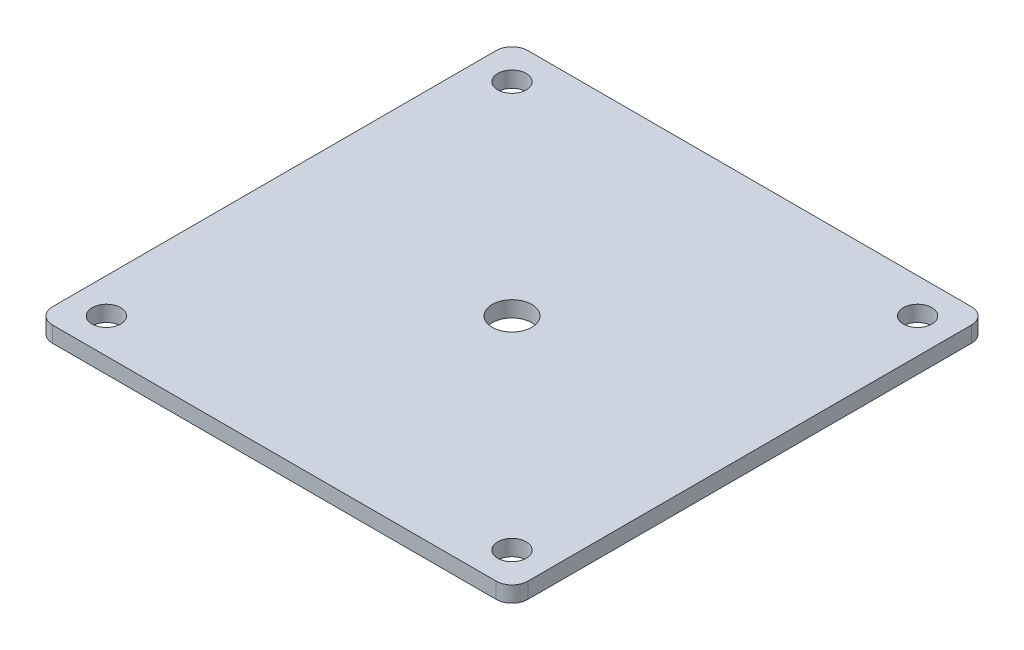
ISO-10303-21;
HEADER;
FILE_DESCRIPTION(('STEP AP214'),'2;1');
FILE_NAME('part.step','',(''),(''),'','','');
FILE_SCHEMA(('AUTOMOTIVE_DESIGN { 1 0 10303 214 1 1 1 1 }'));
ENDSEC;
DATA;
#1=APPLICATION_CONTEXT('core data for automotive mechanical design processes');
#2=APPLICATION_PROTOCOL_DEFINITION('international standard','automotive_design',2000,#1);
#3=PRODUCT_CONTEXT('',#1,'mechanical');
#4=PRODUCT('Part','Part','',(#3));
#5=PRODUCT_RELATED_PRODUCT_CATEGORY('part','',(#4));
#6=PRODUCT_DEFINITION_FORMATION('','',#4);
#7=PRODUCT_DEFINITION_CONTEXT('part definition',#1,'design');
#8=PRODUCT_DEFINITION('design','',#6,#7);
#9=PRODUCT_DEFINITION_SHAPE('','',#8);
#10=(LENGTH_UNIT() NAMED_UNIT(*) SI_UNIT(.MILLI.,.METRE.));
#11=(NAMED_UNIT(*) PLANE_ANGLE_UNIT() SI_UNIT($,.RADIAN.));
#12=(NAMED_UNIT(*) SI_UNIT($,.STERADIAN.) SOLID_ANGLE_UNIT());
#13=UNCERTAINTY_MEASURE_WITH_UNIT(LENGTH_MEASURE(1.E-05),#10,'distance_accuracy_value','');
#14=(GEOMETRIC_REPRESENTATION_CONTEXT(3) GLOBAL_UNCERTAINTY_ASSIGNED_CONTEXT((#13)) GLOBAL_UNIT_ASSIGNED_CONTEXT((#10,
#11,#12)) REPRESENTATION_CONTEXT('',''));
#15=CARTESIAN_POINT('',(0.,0.,0.));
#16=DIRECTION('',(0.,0.,1.));
#17=DIRECTION('',(1.,0.,0.));
#18=AXIS2_PLACEMENT_3D('',#15,#16,#17);
#19=CARTESIAN_POINT('',(38.1,2.54,-38.1));
#20=DIRECTION('',(-1.,0.,0.));
#21=DIRECTION('',(0.,0.,1.));
#22=AXIS2_PLACEMENT_3D('',#19,#20,#21);
#23=PLANE('',#22);
#24=DIRECTION('',(0.,0.,-1.));
#25=VECTOR('',#24,1.);
#26=CARTESIAN_POINT('',(38.1,2.54,-38.1));
#27=LINE('',#26,#25);
#28=CARTESIAN_POINT('',(38.1,2.54,35.56));
#29=VERTEX_POINT('',#28);
#30=CARTESIAN_POINT('',(38.1,2.54,-35.56));
#31=VERTEX_POINT('',#30);
#32=EDGE_CURVE('E128',#29,#31,#27,.T.);
#33=ORIENTED_EDGE('',*,*,#32,.F.);
#34=DIRECTION('',(0.,-1.,0.));
#35=VECTOR('',#34,1.);
#36=CARTESIAN_POINT('',(38.1,2.54,35.56));
#37=LINE('',#36,#35);
#38=CARTESIAN_POINT('',(38.1,0.,35.56));
#39=VERTEX_POINT('',#38);
#40=EDGE_CURVE('E11',#29,#39,#37,.T.);
#41=ORIENTED_EDGE('',*,*,#40,.T.);
#42=DIRECTION('',(0.,0.,-1.));
#43=VECTOR('',#42,1.);
#44=CARTESIAN_POINT('',(38.1,0.,-38.1));
#45=LINE('',#44,#43);
#46=CARTESIAN_POINT('',(38.1,0.,-35.56));
#47=VERTEX_POINT('',#46);
#48=EDGE_CURVE('E130',#39,#47,#45,.T.);
#49=ORIENTED_EDGE('',*,*,#48,.T.);
#50=DIRECTION('',(0.,-1.,0.));
#51=VECTOR('',#50,1.);
#52=CARTESIAN_POINT('',(38.1,2.54,-35.56));
#53=LINE('',#52,#51);
#54=EDGE_CURVE('E41',#47,#31,#53,.F.);
#55=ORIENTED_EDGE('',*,*,#54,.T.);
#56=EDGE_LOOP('',(#33,#41,#49,#55));
#57=FACE_BOUND('',#56,.T.);
#58=ADVANCED_FACE('F33',(#57),#23,.F.);
#59=CARTESIAN_POINT('',(-38.1,2.54,-38.1));
#60=DIRECTION('',(0.,0.,1.));
#61=DIRECTION('',(1.,0.,0.));
#62=AXIS2_PLACEMENT_3D('',#59,#60,#61);
#63=PLANE('',#62);
#64=DIRECTION('',(-1.,0.,0.));
#65=VECTOR('',#64,1.);
#66=CARTESIAN_POINT('',(-38.1,0.,-38.1));
#67=LINE('',#66,#65);
#68=CARTESIAN_POINT('',(35.56,0.,-38.1));
#69=VERTEX_POINT('',#68);
#70=CARTESIAN_POINT('',(-35.56,0.,-38.1));
#71=VERTEX_POINT('',#70);
#72=EDGE_CURVE('E126',#69,#71,#67,.T.);
#73=ORIENTED_EDGE('',*,*,#72,.T.);
#74=DIRECTION('',(0.,-1.,0.));
#75=VECTOR('',#74,1.);
#76=CARTESIAN_POINT('',(-35.56,2.54,-38.1));
#77=LINE('',#76,#75);
#78=CARTESIAN_POINT('',(-35.56,2.54,-38.1));
#79=VERTEX_POINT('',#78);
#80=EDGE_CURVE('E105',#71,#79,#77,.F.);
#81=ORIENTED_EDGE('',*,*,#80,.T.);
#82=DIRECTION('',(-1.,0.,0.));
#83=VECTOR('',#82,1.);
#84=CARTESIAN_POINT('',(-38.1,2.54,-38.1));
#85=LINE('',#84,#83);
#86=CARTESIAN_POINT('',(35.56,2.54,-38.1));
#87=VERTEX_POINT('',#86);
#88=EDGE_CURVE('E166',#87,#79,#85,.T.);
#89=ORIENTED_EDGE('',*,*,#88,.F.);
#90=DIRECTION('',(0.,-1.,0.));
#91=VECTOR('',#90,1.);
#92=CARTESIAN_POINT('',(35.56,2.54,-38.1));
#93=LINE('',#92,#91);
#94=EDGE_CURVE('E110',#87,#69,#93,.T.);
#95=ORIENTED_EDGE('',*,*,#94,.T.);
#96=EDGE_LOOP('',(#73,#81,#89,#95));
#97=FACE_BOUND('',#96,.T.);
#98=ADVANCED_FACE('F170',(#97),#63,.F.);
#99=CARTESIAN_POINT('',(-38.1,2.54,-38.1));
#100=DIRECTION('',(1.,0.,0.));
#101=DIRECTION('',(0.,0.,-1.));
#102=AXIS2_PLACEMENT_3D('',#99,#100,#101);
#103=PLANE('',#102);
#104=DIRECTION('',(0.,0.,1.));
#105=VECTOR('',#104,1.);
#106=CARTESIAN_POINT('',(-38.1,2.54,-38.1));
#107=LINE('',#106,#105);
#108=CARTESIAN_POINT('',(-38.1,2.54,-35.56));
#109=VERTEX_POINT('',#108);
#110=CARTESIAN_POINT('',(-38.1,2.54,35.56));
#111=VERTEX_POINT('',#110);
#112=EDGE_CURVE('E119',#109,#111,#107,.T.);
#113=ORIENTED_EDGE('',*,*,#112,.F.);
#114=DIRECTION('',(0.,-1.,0.));
#115=VECTOR('',#114,1.);
#116=CARTESIAN_POINT('',(-38.1,2.54,-35.56));
#117=LINE('',#116,#115);
#118=CARTESIAN_POINT('',(-38.1,0.,-35.56));
#119=VERTEX_POINT('',#118);
#120=EDGE_CURVE('E104',#109,#119,#117,.T.);
#121=ORIENTED_EDGE('',*,*,#120,.T.);
#122=DIRECTION('',(0.,0.,1.));
#123=VECTOR('',#122,1.);
#124=CARTESIAN_POINT('',(-38.1,0.,-38.1));
#125=LINE('',#124,#123);
#126=CARTESIAN_POINT('',(-38.1,0.,35.56));
#127=VERTEX_POINT('',#126);
#128=EDGE_CURVE('E117',#119,#127,#125,.T.);
#129=ORIENTED_EDGE('',*,*,#128,.T.);
#130=DIRECTION('',(0.,-1.,0.));
#131=VECTOR('',#130,1.);
#132=CARTESIAN_POINT('',(-38.1,2.54,35.56));
#133=LINE('',#132,#131);
#134=EDGE_CURVE('E121',#127,#111,#133,.F.);
#135=ORIENTED_EDGE('',*,*,#134,.T.);
#136=EDGE_LOOP('',(#113,#121,#129,#135));
#137=FACE_BOUND('',#136,.T.);
#138=ADVANCED_FACE('F116',(#137),#103,.F.);
#139=CARTESIAN_POINT('',(-38.1,2.54,38.1));
#140=DIRECTION('',(0.,0.,-1.));
#141=DIRECTION('',(-1.,0.,0.));
#142=AXIS2_PLACEMENT_3D('',#139,#140,#141);
#143=PLANE('',#142);
#144=DIRECTION('',(1.,0.,0.));
#145=VECTOR('',#144,1.);
#146=CARTESIAN_POINT('',(-38.1,2.54,38.1));
#147=LINE('',#146,#145);
#148=CARTESIAN_POINT('',(-35.56,2.54,38.1));
#149=VERTEX_POINT('',#148);
#150=CARTESIAN_POINT('',(35.56,2.54,38.1));
#151=VERTEX_POINT('',#150);
#152=EDGE_CURVE('E134',#149,#151,#147,.T.);
#153=ORIENTED_EDGE('',*,*,#152,.F.);
#154=DIRECTION('',(0.,-1.,0.));
#155=VECTOR('',#154,1.);
#156=CARTESIAN_POINT('',(-35.56,2.54,38.1));
#157=LINE('',#156,#155);
#158=CARTESIAN_POINT('',(-35.56,0.,38.1));
#159=VERTEX_POINT('',#158);
#160=EDGE_CURVE('E151',#149,#159,#157,.T.);
#161=ORIENTED_EDGE('',*,*,#160,.T.);
#162=DIRECTION('',(1.,0.,0.));
#163=VECTOR('',#162,1.);
#164=CARTESIAN_POINT('',(-38.1,0.,38.1));
#165=LINE('',#164,#163);
#166=CARTESIAN_POINT('',(35.56,0.,38.1));
#167=VERTEX_POINT('',#166);
#168=EDGE_CURVE('E125',#159,#167,#165,.T.);
#169=ORIENTED_EDGE('',*,*,#168,.T.);
#170=DIRECTION('',(0.,-1.,0.));
#171=VECTOR('',#170,1.);
#172=CARTESIAN_POINT('',(35.56,2.54,38.1));
#173=LINE('',#172,#171);
#174=EDGE_CURVE('E48',#167,#151,#173,.F.);
#175=ORIENTED_EDGE('',*,*,#174,.T.);
#176=EDGE_LOOP('',(#153,#161,#169,#175));
#177=FACE_BOUND('',#176,.T.);
#178=ADVANCED_FACE('F217',(#177),#143,.F.);
#179=CARTESIAN_POINT('',(0.,2.54,0.));
#180=DIRECTION('',(0.,1.,0.));
#181=DIRECTION('',(0.,0.,1.));
#182=AXIS2_PLACEMENT_3D('',#179,#180,#181);
#183=PLANE('',#182);
#184=CARTESIAN_POINT('',(0.,2.54,0.));
#185=DIRECTION('',(0.,1.,0.));
#186=DIRECTION('',(0.,0.,1.));
#187=AXIS2_PLACEMENT_3D('',#184,#185,#186);
#188=CIRCLE('',#187,3.175);
#189=CARTESIAN_POINT('',(0.,2.54,3.175));
#190=VERTEX_POINT('',#189);
#191=EDGE_CURVE('E200',#190,#190,#188,.T.);
#192=ORIENTED_EDGE('',*,*,#191,.F.);
#193=EDGE_LOOP('',(#192));
#194=FACE_BOUND('',#193,.T.);
#195=CARTESIAN_POINT('',(-32.512,2.54,32.512));
#196=DIRECTION('',(0.,1.,0.));
#197=DIRECTION('',(0.,0.,1.));
#198=AXIS2_PLACEMENT_3D('',#195,#196,#197);
#199=CIRCLE('',#198,2.286);
#200=CARTESIAN_POINT('',(-32.512,2.54,34.798));
#201=VERTEX_POINT('',#200);
#202=EDGE_CURVE('E182',#201,#201,#199,.T.);
#203=ORIENTED_EDGE('',*,*,#202,.F.);
#204=EDGE_LOOP('',(#203));
#205=FACE_BOUND('',#204,.T.);
#206=CARTESIAN_POINT('',(32.512,2.54,32.512));
#207=DIRECTION('',(0.,1.,0.));
#208=DIRECTION('',(0.,0.,1.));
#209=AXIS2_PLACEMENT_3D('',#206,#207,#208);
#210=CIRCLE('',#209,2.28599999999999);
#211=CARTESIAN_POINT('',(32.512,2.54,34.798));
#212=VERTEX_POINT('',#211);
#213=EDGE_CURVE('E189',#212,#212,#210,.T.);
#214=ORIENTED_EDGE('',*,*,#213,.F.);
#215=EDGE_LOOP('',(#214));
#216=FACE_BOUND('',#215,.T.);
#217=CARTESIAN_POINT('',(32.512,2.54,-32.512));
#218=DIRECTION('',(0.,1.,0.));
#219=DIRECTION('',(0.,0.,1.));
#220=AXIS2_PLACEMENT_3D('',#217,#218,#219);
#221=CIRCLE('',#220,2.28599999999999);
#222=CARTESIAN_POINT('',(32.512,2.54,-30.226));
#223=VERTEX_POINT('',#222);
#224=EDGE_CURVE('E195',#223,#223,#221,.T.);
#225=ORIENTED_EDGE('',*,*,#224,.F.);
#226=EDGE_LOOP('',(#225));
#227=FACE_BOUND('',#226,.T.);
#228=CARTESIAN_POINT('',(-32.512,2.54,-32.512));
#229=DIRECTION('',(0.,1.,0.));
#230=DIRECTION('',(0.,0.,1.));
#231=AXIS2_PLACEMENT_3D('',#228,#229,#230);
#232=CIRCLE('',#231,2.286);
#233=CARTESIAN_POINT('',(-32.512,2.54,-30.226));
#234=VERTEX_POINT('',#233);
#235=EDGE_CURVE('E173',#234,#234,#232,.T.);
#236=ORIENTED_EDGE('',*,*,#235,.F.);
#237=EDGE_LOOP('',(#236));
#238=FACE_BOUND('',#237,.T.);
#239=ORIENTED_EDGE('',*,*,#88,.T.);
#240=CARTESIAN_POINT('',(-35.56,2.54,-35.56));
#241=DIRECTION('',(0.,1.,0.));
#242=DIRECTION('',(0.,0.,1.));
#243=AXIS2_PLACEMENT_3D('',#240,#241,#242);
#244=CIRCLE('',#243,2.54);
#245=EDGE_CURVE('E148',#79,#109,#244,.T.);
#246=ORIENTED_EDGE('',*,*,#245,.T.);
#247=ORIENTED_EDGE('',*,*,#112,.T.);
#248=CARTESIAN_POINT('',(-35.56,2.54,35.56));
#249=DIRECTION('',(0.,1.,0.));
#250=DIRECTION('',(0.,0.,1.));
#251=AXIS2_PLACEMENT_3D('',#248,#249,#250);
#252=CIRCLE('',#251,2.54);
#253=EDGE_CURVE('E55',#111,#149,#252,.T.);
#254=ORIENTED_EDGE('',*,*,#253,.T.);
#255=ORIENTED_EDGE('',*,*,#152,.T.);
#256=CARTESIAN_POINT('',(35.56,2.54,35.56));
#257=DIRECTION('',(0.,1.,0.));
#258=DIRECTION('',(0.,0.,1.));
#259=AXIS2_PLACEMENT_3D('',#256,#257,#258);
#260=CIRCLE('',#259,2.54);
#261=EDGE_CURVE('E145',#151,#29,#260,.T.);
#262=ORIENTED_EDGE('',*,*,#261,.T.);
#263=ORIENTED_EDGE('',*,*,#32,.T.);
#264=CARTESIAN_POINT('',(35.56,2.54,-35.56));
#265=DIRECTION('',(0.,1.,0.));
#266=DIRECTION('',(0.,0.,1.));
#267=AXIS2_PLACEMENT_3D('',#264,#265,#266);
#268=CIRCLE('',#267,2.54);
#269=EDGE_CURVE('E143',#31,#87,#268,.T.);
#270=ORIENTED_EDGE('',*,*,#269,.T.);
#271=EDGE_LOOP('',(#239,#246,#247,#254,#255,#262,#263,#270));
#272=FACE_BOUND('',#271,.T.);
#273=ADVANCED_FACE('F163',(#194,#205,#216,#227,#238,#272),#183,.T.);
#274=CARTESIAN_POINT('',(0.,0.,0.));
#275=DIRECTION('',(0.,1.,0.));
#276=DIRECTION('',(0.,0.,1.));
#277=AXIS2_PLACEMENT_3D('',#274,#275,#276);
#278=PLANE('',#277);
#279=CARTESIAN_POINT('',(0.,0.,0.));
#280=DIRECTION('',(0.,1.,0.));
#281=DIRECTION('',(0.,0.,1.));
#282=AXIS2_PLACEMENT_3D('',#279,#280,#281);
#283=CIRCLE('',#282,3.175);
#284=CARTESIAN_POINT('',(0.,0.,3.175));
#285=VERTEX_POINT('',#284);
#286=EDGE_CURVE('E186',#285,#285,#283,.T.);
#287=ORIENTED_EDGE('',*,*,#286,.T.);
#288=EDGE_LOOP('',(#287));
#289=FACE_BOUND('',#288,.T.);
#290=CARTESIAN_POINT('',(-32.512,0.,32.512));
#291=DIRECTION('',(0.,1.,0.));
#292=DIRECTION('',(0.,0.,1.));
#293=AXIS2_PLACEMENT_3D('',#290,#291,#292);
#294=CIRCLE('',#293,2.286);
#295=CARTESIAN_POINT('',(-32.512,0.,34.798));
#296=VERTEX_POINT('',#295);
#297=EDGE_CURVE('E185',#296,#296,#294,.T.);
#298=ORIENTED_EDGE('',*,*,#297,.T.);
#299=EDGE_LOOP('',(#298));
#300=FACE_BOUND('',#299,.T.);
#301=CARTESIAN_POINT('',(32.512,0.,32.512));
#302=DIRECTION('',(0.,1.,0.));
#303=DIRECTION('',(0.,0.,1.));
#304=AXIS2_PLACEMENT_3D('',#301,#302,#303);
#305=CIRCLE('',#304,2.28599999999999);
#306=CARTESIAN_POINT('',(32.512,0.,34.798));
#307=VERTEX_POINT('',#306);
#308=EDGE_CURVE('E192',#307,#307,#305,.T.);
#309=ORIENTED_EDGE('',*,*,#308,.T.);
#310=EDGE_LOOP('',(#309));
#311=FACE_BOUND('',#310,.T.);
#312=CARTESIAN_POINT('',(32.512,0.,-32.512));
#313=DIRECTION('',(0.,1.,0.));
#314=DIRECTION('',(0.,0.,1.));
#315=AXIS2_PLACEMENT_3D('',#312,#313,#314);
#316=CIRCLE('',#315,2.28599999999999);
#317=CARTESIAN_POINT('',(32.512,0.,-30.226));
#318=VERTEX_POINT('',#317);
#319=EDGE_CURVE('E180',#318,#318,#316,.T.);
#320=ORIENTED_EDGE('',*,*,#319,.T.);
#321=EDGE_LOOP('',(#320));
#322=FACE_BOUND('',#321,.T.);
#323=CARTESIAN_POINT('',(-32.512,0.,-32.512));
#324=DIRECTION('',(0.,1.,0.));
#325=DIRECTION('',(0.,0.,1.));
#326=AXIS2_PLACEMENT_3D('',#323,#324,#325);
#327=CIRCLE('',#326,2.286);
#328=CARTESIAN_POINT('',(-32.512,0.,-30.226));
#329=VERTEX_POINT('',#328);
#330=EDGE_CURVE('E171',#329,#329,#327,.T.);
#331=ORIENTED_EDGE('',*,*,#330,.T.);
#332=EDGE_LOOP('',(#331));
#333=FACE_BOUND('',#332,.T.);
#334=ORIENTED_EDGE('',*,*,#128,.F.);
#335=CARTESIAN_POINT('',(-35.56,0.,-35.56));
#336=DIRECTION('',(0.,1.,0.));
#337=DIRECTION('',(0.,0.,1.));
#338=AXIS2_PLACEMENT_3D('',#335,#336,#337);
#339=CIRCLE('',#338,2.54);
#340=EDGE_CURVE('E100',#119,#71,#339,.F.);
#341=ORIENTED_EDGE('',*,*,#340,.T.);
#342=ORIENTED_EDGE('',*,*,#72,.F.);
#343=CARTESIAN_POINT('',(35.56,0.,-35.56));
#344=DIRECTION('',(0.,1.,0.));
#345=DIRECTION('',(0.,0.,1.));
#346=AXIS2_PLACEMENT_3D('',#343,#344,#345);
#347=CIRCLE('',#346,2.54);
#348=EDGE_CURVE('E120',#69,#47,#347,.F.);
#349=ORIENTED_EDGE('',*,*,#348,.T.);
#350=ORIENTED_EDGE('',*,*,#48,.F.);
#351=CARTESIAN_POINT('',(35.56,0.,35.56));
#352=DIRECTION('',(0.,1.,0.));
#353=DIRECTION('',(0.,0.,1.));
#354=AXIS2_PLACEMENT_3D('',#351,#352,#353);
#355=CIRCLE('',#354,2.54);
#356=EDGE_CURVE('E137',#39,#167,#355,.F.);
#357=ORIENTED_EDGE('',*,*,#356,.T.);
#358=ORIENTED_EDGE('',*,*,#168,.F.);
#359=CARTESIAN_POINT('',(-35.56,0.,35.56));
#360=DIRECTION('',(0.,1.,0.));
#361=DIRECTION('',(0.,0.,1.));
#362=AXIS2_PLACEMENT_3D('',#359,#360,#361);
#363=CIRCLE('',#362,2.54);
#364=EDGE_CURVE('E111',#159,#127,#363,.F.);
#365=ORIENTED_EDGE('',*,*,#364,.T.);
#366=EDGE_LOOP('',(#334,#341,#342,#349,#350,#357,#358,#365));
#367=FACE_BOUND('',#366,.T.);
#368=ADVANCED_FACE('F123',(#289,#300,#311,#322,#333,#367),#278,.F.);
#369=CARTESIAN_POINT('',(-32.512,0.,-32.512));
#370=DIRECTION('',(0.,1.,0.));
#371=DIRECTION('',(0.,0.,1.));
#372=AXIS2_PLACEMENT_3D('',#369,#370,#371);
#373=CYLINDRICAL_SURFACE('',#372,2.286);
#374=ORIENTED_EDGE('',*,*,#330,.F.);
#375=EDGE_LOOP('',(#374));
#376=FACE_BOUND('',#375,.T.);
#377=ORIENTED_EDGE('',*,*,#235,.T.);
#378=EDGE_LOOP('',(#377));
#379=FACE_BOUND('',#378,.T.);
#380=ADVANCED_FACE('F227',(#376,#379),#373,.F.);
#381=CARTESIAN_POINT('',(32.512,0.,-32.512));
#382=DIRECTION('',(0.,1.,0.));
#383=DIRECTION('',(0.,0.,1.));
#384=AXIS2_PLACEMENT_3D('',#381,#382,#383);
#385=CYLINDRICAL_SURFACE('',#384,2.28599999999999);
#386=ORIENTED_EDGE('',*,*,#319,.F.);
#387=EDGE_LOOP('',(#386));
#388=FACE_BOUND('',#387,.T.);
#389=ORIENTED_EDGE('',*,*,#224,.T.);
#390=EDGE_LOOP('',(#389));
#391=FACE_BOUND('',#390,.T.);
#392=ADVANCED_FACE('F229',(#388,#391),#385,.F.);
#393=CARTESIAN_POINT('',(32.512,0.,32.512));
#394=DIRECTION('',(0.,1.,0.));
#395=DIRECTION('',(0.,0.,1.));
#396=AXIS2_PLACEMENT_3D('',#393,#394,#395);
#397=CYLINDRICAL_SURFACE('',#396,2.28599999999999);
#398=ORIENTED_EDGE('',*,*,#308,.F.);
#399=EDGE_LOOP('',(#398));
#400=FACE_BOUND('',#399,.T.);
#401=ORIENTED_EDGE('',*,*,#213,.T.);
#402=EDGE_LOOP('',(#401));
#403=FACE_BOUND('',#402,.T.);
#404=ADVANCED_FACE('F236',(#400,#403),#397,.F.);
#405=CARTESIAN_POINT('',(-32.512,0.,32.512));
#406=DIRECTION('',(0.,1.,0.));
#407=DIRECTION('',(0.,0.,1.));
#408=AXIS2_PLACEMENT_3D('',#405,#406,#407);
#409=CYLINDRICAL_SURFACE('',#408,2.286);
#410=ORIENTED_EDGE('',*,*,#297,.F.);
#411=EDGE_LOOP('',(#410));
#412=FACE_BOUND('',#411,.T.);
#413=ORIENTED_EDGE('',*,*,#202,.T.);
#414=EDGE_LOOP('',(#413));
#415=FACE_BOUND('',#414,.T.);
#416=ADVANCED_FACE('F211',(#412,#415),#409,.F.);
#417=CARTESIAN_POINT('',(0.,0.,0.));
#418=DIRECTION('',(0.,1.,0.));
#419=DIRECTION('',(0.,0.,1.));
#420=AXIS2_PLACEMENT_3D('',#417,#418,#419);
#421=CYLINDRICAL_SURFACE('',#420,3.175);
#422=ORIENTED_EDGE('',*,*,#286,.F.);
#423=EDGE_LOOP('',(#422));
#424=FACE_BOUND('',#423,.T.);
#425=ORIENTED_EDGE('',*,*,#191,.T.);
#426=EDGE_LOOP('',(#425));
#427=FACE_BOUND('',#426,.T.);
#428=ADVANCED_FACE('F208',(#424,#427),#421,.F.);
#429=CARTESIAN_POINT('',(-35.56,2.54,-35.56));
#430=DIRECTION('',(0.,-1.,0.));
#431=DIRECTION('',(0.,0.,-1.));
#432=AXIS2_PLACEMENT_3D('',#429,#430,#431);
#433=CYLINDRICAL_SURFACE('',#432,2.54);
#434=ORIENTED_EDGE('',*,*,#245,.F.);
#435=ORIENTED_EDGE('',*,*,#80,.F.);
#436=ORIENTED_EDGE('',*,*,#340,.F.);
#437=ORIENTED_EDGE('',*,*,#120,.F.);
#438=EDGE_LOOP('',(#434,#435,#436,#437));
#439=FACE_BOUND('',#438,.T.);
#440=ADVANCED_FACE('F103',(#439),#433,.T.);
#441=CARTESIAN_POINT('',(-35.56,2.54,35.56));
#442=DIRECTION('',(0.,-1.,0.));
#443=DIRECTION('',(0.,0.,-1.));
#444=AXIS2_PLACEMENT_3D('',#441,#442,#443);
#445=CYLINDRICAL_SURFACE('',#444,2.54);
#446=ORIENTED_EDGE('',*,*,#253,.F.);
#447=ORIENTED_EDGE('',*,*,#134,.F.);
#448=ORIENTED_EDGE('',*,*,#364,.F.);
#449=ORIENTED_EDGE('',*,*,#160,.F.);
#450=EDGE_LOOP('',(#446,#447,#448,#449));
#451=FACE_BOUND('',#450,.T.);
#452=ADVANCED_FACE('F252',(#451),#445,.T.);
#453=CARTESIAN_POINT('',(35.56,2.54,35.56));
#454=DIRECTION('',(0.,-1.,0.));
#455=DIRECTION('',(0.,0.,-1.));
#456=AXIS2_PLACEMENT_3D('',#453,#454,#455);
#457=CYLINDRICAL_SURFACE('',#456,2.54);
#458=ORIENTED_EDGE('',*,*,#261,.F.);
#459=ORIENTED_EDGE('',*,*,#174,.F.);
#460=ORIENTED_EDGE('',*,*,#356,.F.);
#461=ORIENTED_EDGE('',*,*,#40,.F.);
#462=EDGE_LOOP('',(#458,#459,#460,#461));
#463=FACE_BOUND('',#462,.T.);
#464=ADVANCED_FACE('F254',(#463),#457,.T.);
#465=CARTESIAN_POINT('',(35.56,2.54,-35.56));
#466=DIRECTION('',(0.,-1.,0.));
#467=DIRECTION('',(0.,0.,-1.));
#468=AXIS2_PLACEMENT_3D('',#465,#466,#467);
#469=CYLINDRICAL_SURFACE('',#468,2.54);
#470=ORIENTED_EDGE('',*,*,#269,.F.);
#471=ORIENTED_EDGE('',*,*,#54,.F.);
#472=ORIENTED_EDGE('',*,*,#348,.F.);
#473=ORIENTED_EDGE('',*,*,#94,.F.);
#474=EDGE_LOOP('',(#470,#471,#472,#473));
#475=FACE_BOUND('',#474,.T.);
#476=ADVANCED_FACE('F35',(#475),#469,.T.);
#477=CLOSED_SHELL('',(#58,#98,#138,#178,#273,#368,#380,#392,#404,#416,#428,#440,#452,#464,#476));
#478=MANIFOLD_SOLID_BREP('B2',#477);
#479=ADVANCED_BREP_SHAPE_REPRESENTATION('',(#18,#478),#14);
#480=SHAPE_DEFINITION_REPRESENTATION(#9,#479);
ENDSEC;
END-ISO-10303-21;
